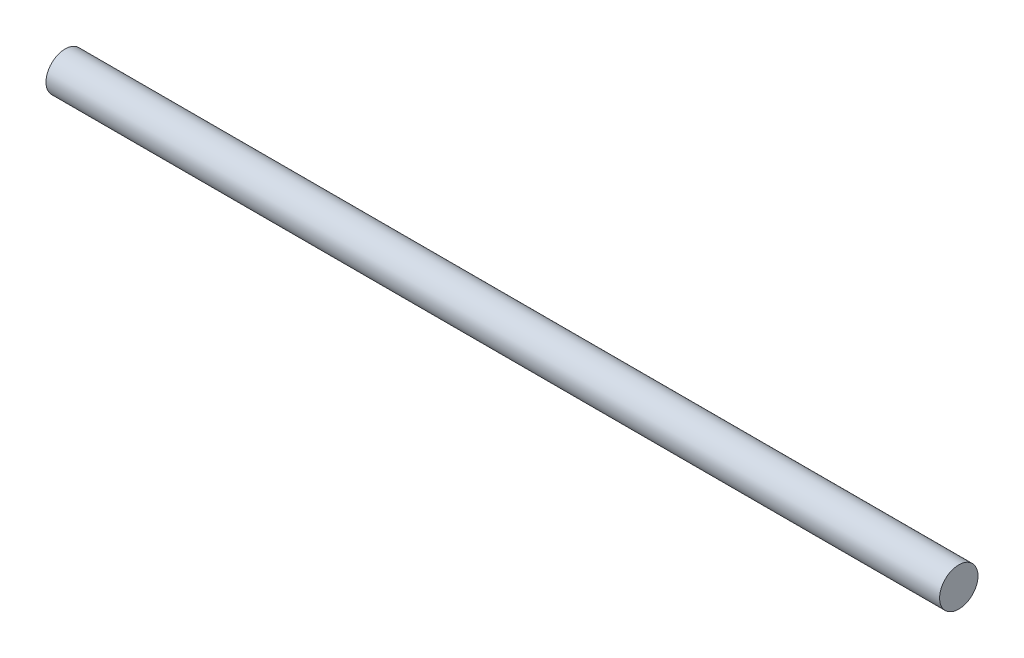
ISO-10303-21;
HEADER;
FILE_DESCRIPTION(('STEP AP214'),'2;1');
FILE_NAME('part.step','',(''),(''),'','','');
FILE_SCHEMA(('AUTOMOTIVE_DESIGN { 1 0 10303 214 1 1 1 1 }'));
ENDSEC;
DATA;
#1=APPLICATION_CONTEXT('core data for automotive mechanical design processes');
#2=APPLICATION_PROTOCOL_DEFINITION('international standard','automotive_design',2000,#1);
#3=PRODUCT_CONTEXT('',#1,'mechanical');
#4=PRODUCT('Part','Part','',(#3));
#5=PRODUCT_RELATED_PRODUCT_CATEGORY('part','',(#4));
#6=PRODUCT_DEFINITION_FORMATION('','',#4);
#7=PRODUCT_DEFINITION_CONTEXT('part definition',#1,'design');
#8=PRODUCT_DEFINITION('design','',#6,#7);
#9=PRODUCT_DEFINITION_SHAPE('','',#8);
#10=(LENGTH_UNIT() NAMED_UNIT(*) SI_UNIT(.MILLI.,.METRE.));
#11=(NAMED_UNIT(*) PLANE_ANGLE_UNIT() SI_UNIT($,.RADIAN.));
#12=(NAMED_UNIT(*) SI_UNIT($,.STERADIAN.) SOLID_ANGLE_UNIT());
#13=UNCERTAINTY_MEASURE_WITH_UNIT(LENGTH_MEASURE(1.E-05),#10,'distance_accuracy_value','');
#14=(GEOMETRIC_REPRESENTATION_CONTEXT(3) GLOBAL_UNCERTAINTY_ASSIGNED_CONTEXT((#13)) GLOBAL_UNIT_ASSIGNED_CONTEXT((#10,
#11,#12)) REPRESENTATION_CONTEXT('',''));
#15=CARTESIAN_POINT('',(0.,0.,0.));
#16=DIRECTION('',(0.,0.,1.));
#17=DIRECTION('',(1.,0.,0.));
#18=AXIS2_PLACEMENT_3D('',#15,#16,#17);
#19=CARTESIAN_POINT('',(25.4,0.,0.));
#20=DIRECTION('',(-1.,0.,0.));
#21=DIRECTION('',(0.,0.,1.));
#22=AXIS2_PLACEMENT_3D('',#19,#20,#21);
#23=CYLINDRICAL_SURFACE('',#22,1.0922);
#24=CARTESIAN_POINT('',(25.4,0.,0.));
#25=DIRECTION('',(1.,0.,0.));
#26=DIRECTION('',(0.,0.,-1.));
#27=AXIS2_PLACEMENT_3D('',#24,#25,#26);
#28=CIRCLE('',#27,1.0922);
#29=CARTESIAN_POINT('',(25.4,0.,-1.0922));
#30=VERTEX_POINT('',#29);
#31=EDGE_CURVE('E10',#30,#30,#28,.T.);
#32=ORIENTED_EDGE('',*,*,#31,.F.);
#33=EDGE_LOOP('',(#32));
#34=FACE_BOUND('',#33,.T.);
#35=CARTESIAN_POINT('',(-25.4,0.,0.));
#36=DIRECTION('',(1.,0.,0.));
#37=DIRECTION('',(0.,0.,-1.));
#38=AXIS2_PLACEMENT_3D('',#35,#36,#37);
#39=CIRCLE('',#38,1.0922);
#40=CARTESIAN_POINT('',(-25.4,0.,-1.0922));
#41=VERTEX_POINT('',#40);
#42=EDGE_CURVE('E37',#41,#41,#39,.T.);
#43=ORIENTED_EDGE('',*,*,#42,.T.);
#44=EDGE_LOOP('',(#43));
#45=FACE_BOUND('',#44,.T.);
#46=ADVANCED_FACE('F34',(#34,#45),#23,.T.);
#47=CARTESIAN_POINT('',(25.4,0.,0.));
#48=DIRECTION('',(1.,0.,0.));
#49=DIRECTION('',(0.,0.,-1.));
#50=AXIS2_PLACEMENT_3D('',#47,#48,#49);
#51=PLANE('',#50);
#52=ORIENTED_EDGE('',*,*,#31,.T.);
#53=EDGE_LOOP('',(#52));
#54=FACE_BOUND('',#53,.T.);
#55=ADVANCED_FACE('F49',(#54),#51,.T.);
#56=CARTESIAN_POINT('',(-25.4,0.,0.));
#57=DIRECTION('',(1.,0.,0.));
#58=DIRECTION('',(0.,0.,-1.));
#59=AXIS2_PLACEMENT_3D('',#56,#57,#58);
#60=PLANE('',#59);
#61=ORIENTED_EDGE('',*,*,#42,.F.);
#62=EDGE_LOOP('',(#61));
#63=FACE_BOUND('',#62,.T.);
#64=ADVANCED_FACE('F47',(#63),#60,.F.);
#65=CLOSED_SHELL('',(#46,#55,#64));
#66=MANIFOLD_SOLID_BREP('B2',#65);
#67=ADVANCED_BREP_SHAPE_REPRESENTATION('',(#18,#66),#14);
#68=SHAPE_DEFINITION_REPRESENTATION(#9,#67);
ENDSEC;
END-ISO-10303-21;
